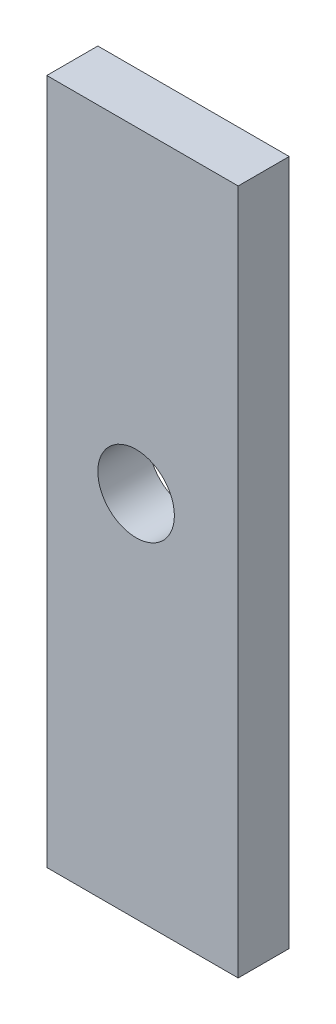
ISO-10303-21;
HEADER;
FILE_DESCRIPTION(('STEP AP214'),'2;1');
FILE_NAME('part.step','',(''),(''),'','','');
FILE_SCHEMA(('AUTOMOTIVE_DESIGN { 1 0 10303 214 1 1 1 1 }'));
ENDSEC;
DATA;
#1=APPLICATION_CONTEXT('core data for automotive mechanical design processes');
#2=APPLICATION_PROTOCOL_DEFINITION('international standard','automotive_design',2000,#1);
#3=PRODUCT_CONTEXT('',#1,'mechanical');
#4=PRODUCT('Part','Part','',(#3));
#5=PRODUCT_RELATED_PRODUCT_CATEGORY('part','',(#4));
#6=PRODUCT_DEFINITION_FORMATION('','',#4);
#7=PRODUCT_DEFINITION_CONTEXT('part definition',#1,'design');
#8=PRODUCT_DEFINITION('design','',#6,#7);
#9=PRODUCT_DEFINITION_SHAPE('','',#8);
#10=(LENGTH_UNIT() NAMED_UNIT(*) SI_UNIT(.MILLI.,.METRE.));
#11=(NAMED_UNIT(*) PLANE_ANGLE_UNIT() SI_UNIT($,.RADIAN.));
#12=(NAMED_UNIT(*) SI_UNIT($,.STERADIAN.) SOLID_ANGLE_UNIT());
#13=UNCERTAINTY_MEASURE_WITH_UNIT(LENGTH_MEASURE(1.E-05),#10,'distance_accuracy_value','');
#14=(GEOMETRIC_REPRESENTATION_CONTEXT(3) GLOBAL_UNCERTAINTY_ASSIGNED_CONTEXT((#13)) GLOBAL_UNIT_ASSIGNED_CONTEXT((#10,
#11,#12)) REPRESENTATION_CONTEXT('',''));
#15=CARTESIAN_POINT('',(0.,0.,0.));
#16=DIRECTION('',(0.,0.,1.));
#17=DIRECTION('',(1.,0.,0.));
#18=AXIS2_PLACEMENT_3D('',#15,#16,#17);
#19=CARTESIAN_POINT('',(0.,0.,2.));
#20=DIRECTION('',(0.,0.,-1.));
#21=DIRECTION('',(-1.,0.,0.));
#22=AXIS2_PLACEMENT_3D('',#19,#20,#21);
#23=PLANE('',#22);
#24=DIRECTION('',(0.,1.,0.));
#25=VECTOR('',#24,1.);
#26=CARTESIAN_POINT('',(4.,-14.441,2.));
#27=LINE('',#26,#25);
#28=CARTESIAN_POINT('',(4.,-14.441,2.));
#29=VERTEX_POINT('',#28);
#30=CARTESIAN_POINT('',(4.,12.44,2.));
#31=VERTEX_POINT('',#30);
#32=EDGE_CURVE('E84',#29,#31,#27,.T.);
#33=ORIENTED_EDGE('',*,*,#32,.T.);
#34=DIRECTION('',(-1.,0.,0.));
#35=VECTOR('',#34,1.);
#36=CARTESIAN_POINT('',(-3.5,12.44,2.));
#37=LINE('',#36,#35);
#38=CARTESIAN_POINT('',(-3.5,12.44,2.));
#39=VERTEX_POINT('',#38);
#40=EDGE_CURVE('E79',#31,#39,#37,.T.);
#41=ORIENTED_EDGE('',*,*,#40,.T.);
#42=DIRECTION('',(0.,-1.,0.));
#43=VECTOR('',#42,1.);
#44=CARTESIAN_POINT('',(-3.5,12.44,2.));
#45=LINE('',#44,#43);
#46=CARTESIAN_POINT('',(-3.5,-14.441,2.));
#47=VERTEX_POINT('',#46);
#48=EDGE_CURVE('E82',#39,#47,#45,.T.);
#49=ORIENTED_EDGE('',*,*,#48,.T.);
#50=DIRECTION('',(1.,0.,0.));
#51=VECTOR('',#50,1.);
#52=CARTESIAN_POINT('',(-3.5,-14.441,2.));
#53=LINE('',#52,#51);
#54=EDGE_CURVE('E49',#47,#29,#53,.T.);
#55=ORIENTED_EDGE('',*,*,#54,.T.);
#56=EDGE_LOOP('',(#33,#41,#49,#55));
#57=FACE_BOUND('',#56,.T.);
#58=CARTESIAN_POINT('',(0.,0.,2.));
#59=DIRECTION('',(0.,0.,1.));
#60=DIRECTION('',(1.,0.,0.));
#61=AXIS2_PLACEMENT_3D('',#58,#59,#60);
#62=CIRCLE('',#61,1.5);
#63=CARTESIAN_POINT('',(1.5,0.,2.));
#64=VERTEX_POINT('',#63);
#65=EDGE_CURVE('E99',#64,#64,#62,.T.);
#66=ORIENTED_EDGE('',*,*,#65,.F.);
#67=EDGE_LOOP('',(#66));
#68=FACE_BOUND('',#67,.T.);
#69=ADVANCED_FACE('F32',(#57,#68),#23,.F.);
#70=CARTESIAN_POINT('',(0.,0.,0.));
#71=DIRECTION('',(0.,0.,-1.));
#72=DIRECTION('',(-1.,0.,0.));
#73=AXIS2_PLACEMENT_3D('',#70,#71,#72);
#74=PLANE('',#73);
#75=DIRECTION('',(0.,1.,0.));
#76=VECTOR('',#75,1.);
#77=CARTESIAN_POINT('',(4.,-14.441,0.));
#78=LINE('',#77,#76);
#79=CARTESIAN_POINT('',(4.,-14.441,0.));
#80=VERTEX_POINT('',#79);
#81=CARTESIAN_POINT('',(4.,12.44,0.));
#82=VERTEX_POINT('',#81);
#83=EDGE_CURVE('E96',#80,#82,#78,.T.);
#84=ORIENTED_EDGE('',*,*,#83,.F.);
#85=DIRECTION('',(1.,0.,0.));
#86=VECTOR('',#85,1.);
#87=CARTESIAN_POINT('',(-3.5,-14.441,0.));
#88=LINE('',#87,#86);
#89=CARTESIAN_POINT('',(-3.5,-14.441,0.));
#90=VERTEX_POINT('',#89);
#91=EDGE_CURVE('E72',#90,#80,#88,.T.);
#92=ORIENTED_EDGE('',*,*,#91,.F.);
#93=DIRECTION('',(0.,-1.,0.));
#94=VECTOR('',#93,1.);
#95=CARTESIAN_POINT('',(-3.5,12.44,0.));
#96=LINE('',#95,#94);
#97=CARTESIAN_POINT('',(-3.5,12.44,0.));
#98=VERTEX_POINT('',#97);
#99=EDGE_CURVE('E66',#98,#90,#96,.T.);
#100=ORIENTED_EDGE('',*,*,#99,.F.);
#101=DIRECTION('',(-1.,0.,0.));
#102=VECTOR('',#101,1.);
#103=CARTESIAN_POINT('',(-3.5,12.44,0.));
#104=LINE('',#103,#102);
#105=EDGE_CURVE('E88',#82,#98,#104,.T.);
#106=ORIENTED_EDGE('',*,*,#105,.F.);
#107=EDGE_LOOP('',(#84,#92,#100,#106));
#108=FACE_BOUND('',#107,.T.);
#109=CARTESIAN_POINT('',(0.,0.,0.));
#110=DIRECTION('',(0.,0.,1.));
#111=DIRECTION('',(1.,0.,0.));
#112=AXIS2_PLACEMENT_3D('',#109,#110,#111);
#113=CIRCLE('',#112,1.5);
#114=CARTESIAN_POINT('',(1.5,0.,0.));
#115=VERTEX_POINT('',#114);
#116=EDGE_CURVE('E111',#115,#115,#113,.T.);
#117=ORIENTED_EDGE('',*,*,#116,.T.);
#118=EDGE_LOOP('',(#117));
#119=FACE_BOUND('',#118,.T.);
#120=ADVANCED_FACE('F107',(#108,#119),#74,.T.);
#121=CARTESIAN_POINT('',(4.,-14.441,2.));
#122=DIRECTION('',(-1.,0.,0.));
#123=DIRECTION('',(0.,-1.,0.));
#124=AXIS2_PLACEMENT_3D('',#121,#122,#123);
#125=PLANE('',#124);
#126=ORIENTED_EDGE('',*,*,#83,.T.);
#127=DIRECTION('',(0.,0.,-1.));
#128=VECTOR('',#127,1.);
#129=CARTESIAN_POINT('',(4.,12.44,2.));
#130=LINE('',#129,#128);
#131=EDGE_CURVE('E11',#31,#82,#130,.T.);
#132=ORIENTED_EDGE('',*,*,#131,.F.);
#133=ORIENTED_EDGE('',*,*,#32,.F.);
#134=DIRECTION('',(0.,0.,-1.));
#135=VECTOR('',#134,1.);
#136=CARTESIAN_POINT('',(4.,-14.441,2.));
#137=LINE('',#136,#135);
#138=EDGE_CURVE('E92',#29,#80,#137,.T.);
#139=ORIENTED_EDGE('',*,*,#138,.T.);
#140=EDGE_LOOP('',(#126,#132,#133,#139));
#141=FACE_BOUND('',#140,.T.);
#142=ADVANCED_FACE('F34',(#141),#125,.F.);
#143=CARTESIAN_POINT('',(-3.5,12.44,2.));
#144=DIRECTION('',(0.,-1.,0.));
#145=DIRECTION('',(0.,0.,-1.));
#146=AXIS2_PLACEMENT_3D('',#143,#144,#145);
#147=PLANE('',#146);
#148=ORIENTED_EDGE('',*,*,#105,.T.);
#149=DIRECTION('',(0.,0.,-1.));
#150=VECTOR('',#149,1.);
#151=CARTESIAN_POINT('',(-3.5,12.44,2.));
#152=LINE('',#151,#150);
#153=EDGE_CURVE('E41',#39,#98,#152,.T.);
#154=ORIENTED_EDGE('',*,*,#153,.F.);
#155=ORIENTED_EDGE('',*,*,#40,.F.);
#156=ORIENTED_EDGE('',*,*,#131,.T.);
#157=EDGE_LOOP('',(#148,#154,#155,#156));
#158=FACE_BOUND('',#157,.T.);
#159=ADVANCED_FACE('F87',(#158),#147,.F.);
#160=CARTESIAN_POINT('',(-3.5,12.44,2.));
#161=DIRECTION('',(1.,0.,0.));
#162=DIRECTION('',(0.,1.,0.));
#163=AXIS2_PLACEMENT_3D('',#160,#161,#162);
#164=PLANE('',#163);
#165=ORIENTED_EDGE('',*,*,#99,.T.);
#166=DIRECTION('',(0.,0.,-1.));
#167=VECTOR('',#166,1.);
#168=CARTESIAN_POINT('',(-3.5,-14.441,2.));
#169=LINE('',#168,#167);
#170=EDGE_CURVE('E89',#47,#90,#169,.T.);
#171=ORIENTED_EDGE('',*,*,#170,.F.);
#172=ORIENTED_EDGE('',*,*,#48,.F.);
#173=ORIENTED_EDGE('',*,*,#153,.T.);
#174=EDGE_LOOP('',(#165,#171,#172,#173));
#175=FACE_BOUND('',#174,.T.);
#176=ADVANCED_FACE('F90',(#175),#164,.F.);
#177=CARTESIAN_POINT('',(-3.5,-14.441,2.));
#178=DIRECTION('',(0.,1.,0.));
#179=DIRECTION('',(0.,0.,1.));
#180=AXIS2_PLACEMENT_3D('',#177,#178,#179);
#181=PLANE('',#180);
#182=ORIENTED_EDGE('',*,*,#91,.T.);
#183=ORIENTED_EDGE('',*,*,#138,.F.);
#184=ORIENTED_EDGE('',*,*,#54,.F.);
#185=ORIENTED_EDGE('',*,*,#170,.T.);
#186=EDGE_LOOP('',(#182,#183,#184,#185));
#187=FACE_BOUND('',#186,.T.);
#188=ADVANCED_FACE('F104',(#187),#181,.F.);
#189=CARTESIAN_POINT('',(0.,0.,2.));
#190=DIRECTION('',(0.,0.,-1.));
#191=DIRECTION('',(-1.,0.,0.));
#192=AXIS2_PLACEMENT_3D('',#189,#190,#191);
#193=CYLINDRICAL_SURFACE('',#192,1.5);
#194=ORIENTED_EDGE('',*,*,#65,.T.);
#195=EDGE_LOOP('',(#194));
#196=FACE_BOUND('',#195,.T.);
#197=ORIENTED_EDGE('',*,*,#116,.F.);
#198=EDGE_LOOP('',(#197));
#199=FACE_BOUND('',#198,.T.);
#200=ADVANCED_FACE('F117',(#196,#199),#193,.F.);
#201=CLOSED_SHELL('',(#69,#120,#142,#159,#176,#188,#200));
#202=MANIFOLD_SOLID_BREP('B2',#201);
#203=ADVANCED_BREP_SHAPE_REPRESENTATION('',(#18,#202),#14);
#204=SHAPE_DEFINITION_REPRESENTATION(#9,#203);
ENDSEC;
END-ISO-10303-21;
